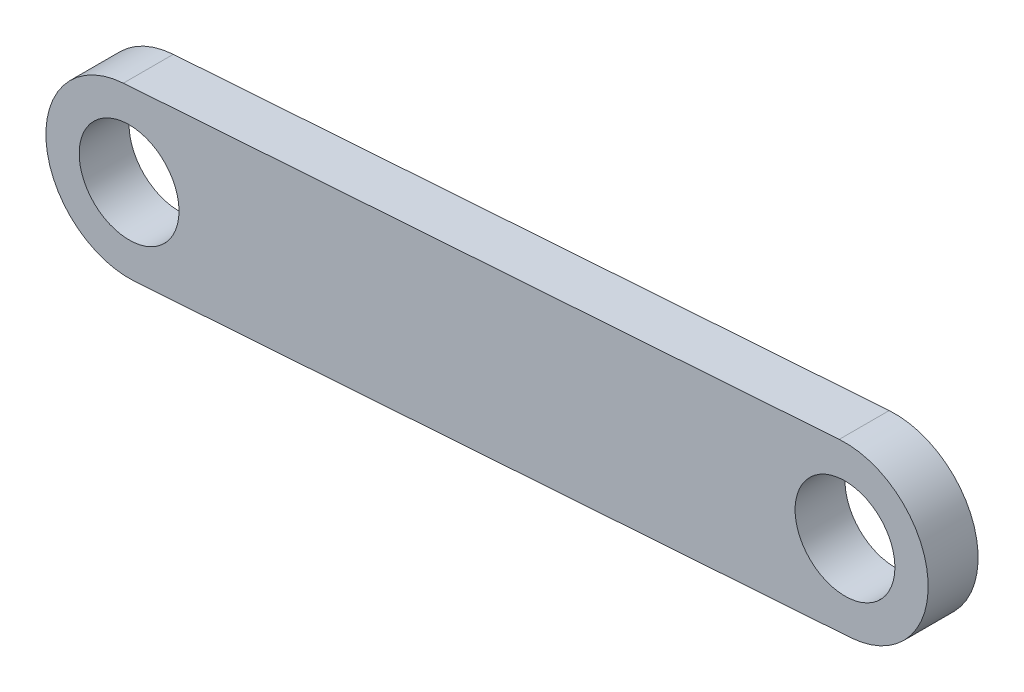
ISO-10303-21;
HEADER;
FILE_DESCRIPTION(('STEP AP214'),'2;1');
FILE_NAME('part.step','',(''),(''),'','','');
FILE_SCHEMA(('AUTOMOTIVE_DESIGN { 1 0 10303 214 1 1 1 1 }'));
ENDSEC;
DATA;
#1=APPLICATION_CONTEXT('core data for automotive mechanical design processes');
#2=APPLICATION_PROTOCOL_DEFINITION('international standard','automotive_design',2000,#1);
#3=PRODUCT_CONTEXT('',#1,'mechanical');
#4=PRODUCT('Part','Part','',(#3));
#5=PRODUCT_RELATED_PRODUCT_CATEGORY('part','',(#4));
#6=PRODUCT_DEFINITION_FORMATION('','',#4);
#7=PRODUCT_DEFINITION_CONTEXT('part definition',#1,'design');
#8=PRODUCT_DEFINITION('design','',#6,#7);
#9=PRODUCT_DEFINITION_SHAPE('','',#8);
#10=(LENGTH_UNIT() NAMED_UNIT(*) SI_UNIT(.MILLI.,.METRE.));
#11=(NAMED_UNIT(*) PLANE_ANGLE_UNIT() SI_UNIT($,.RADIAN.));
#12=(NAMED_UNIT(*) SI_UNIT($,.STERADIAN.) SOLID_ANGLE_UNIT());
#13=UNCERTAINTY_MEASURE_WITH_UNIT(LENGTH_MEASURE(1.E-05),#10,'distance_accuracy_value','');
#14=(GEOMETRIC_REPRESENTATION_CONTEXT(3) GLOBAL_UNCERTAINTY_ASSIGNED_CONTEXT((#13)) GLOBAL_UNIT_ASSIGNED_CONTEXT((#10,
#11,#12)) REPRESENTATION_CONTEXT('',''));
#15=CARTESIAN_POINT('',(0.,0.,0.));
#16=DIRECTION('',(0.,0.,1.));
#17=DIRECTION('',(1.,0.,0.));
#18=AXIS2_PLACEMENT_3D('',#15,#16,#17);
#19=CARTESIAN_POINT('',(0.,0.,7.62));
#20=DIRECTION('',(0.,0.,1.));
#21=DIRECTION('',(1.,0.,0.));
#22=AXIS2_PLACEMENT_3D('',#19,#20,#21);
#23=PLANE('',#22);
#24=CARTESIAN_POINT('',(0.,0.,7.62));
#25=DIRECTION('',(0.,0.,1.));
#26=DIRECTION('',(1.,0.,0.));
#27=AXIS2_PLACEMENT_3D('',#24,#25,#26);
#28=CIRCLE('',#27,7.62);
#29=CARTESIAN_POINT('',(7.62,0.,7.62));
#30=VERTEX_POINT('',#29);
#31=EDGE_CURVE('E102',#30,#30,#28,.T.);
#32=ORIENTED_EDGE('',*,*,#31,.F.);
#33=EDGE_LOOP('',(#32));
#34=FACE_BOUND('',#33,.T.);
#35=CARTESIAN_POINT('',(0.,0.,7.62));
#36=DIRECTION('',(0.,0.,1.));
#37=DIRECTION('',(1.,0.,0.));
#38=AXIS2_PLACEMENT_3D('',#35,#36,#37);
#39=CIRCLE('',#38,12.7);
#40=CARTESIAN_POINT('',(-0.875326503983376,12.6697988741505,7.62));
#41=VERTEX_POINT('',#40);
#42=CARTESIAN_POINT('',(0.875326503983377,-12.6697988741505,7.62));
#43=VERTEX_POINT('',#42);
#44=EDGE_CURVE('E87',#41,#43,#39,.T.);
#45=ORIENTED_EDGE('',*,*,#44,.T.);
#46=DIRECTION('',(0.997621958594524,0.0689233467703446,0.));
#47=VECTOR('',#46,1.);
#48=CARTESIAN_POINT('',(0.875326503983377,-12.6697988741505,7.62));
#49=LINE('',#48,#47);
#50=CARTESIAN_POINT('',(110.152341793531,-5.12010777729385,7.62));
#51=VERTEX_POINT('',#50);
#52=EDGE_CURVE('E82',#43,#51,#49,.T.);
#53=ORIENTED_EDGE('',*,*,#52,.T.);
#54=CARTESIAN_POINT('',(109.277015289548,7.54969109685662,7.62));
#55=DIRECTION('',(0.,0.,1.));
#56=DIRECTION('',(1.,0.,0.));
#57=AXIS2_PLACEMENT_3D('',#54,#55,#56);
#58=CIRCLE('',#57,12.7);
#59=CARTESIAN_POINT('',(108.401688785564,20.2194899710071,7.62));
#60=VERTEX_POINT('',#59);
#61=EDGE_CURVE('E85',#51,#60,#58,.T.);
#62=ORIENTED_EDGE('',*,*,#61,.T.);
#63=DIRECTION('',(-0.997621958594524,-0.0689233467703447,0.));
#64=VECTOR('',#63,1.);
#65=CARTESIAN_POINT('',(-0.875326503983376,12.6697988741505,7.62));
#66=LINE('',#65,#64);
#67=EDGE_CURVE('E52',#60,#41,#66,.T.);
#68=ORIENTED_EDGE('',*,*,#67,.T.);
#69=EDGE_LOOP('',(#45,#53,#62,#68));
#70=FACE_BOUND('',#69,.T.);
#71=CARTESIAN_POINT('',(109.277015289548,7.54969109685662,7.62));
#72=DIRECTION('',(0.,0.,1.));
#73=DIRECTION('',(1.,0.,0.));
#74=AXIS2_PLACEMENT_3D('',#71,#72,#73);
#75=CIRCLE('',#74,7.62000000000003);
#76=CARTESIAN_POINT('',(116.897015289548,7.54969109685662,7.62));
#77=VERTEX_POINT('',#76);
#78=EDGE_CURVE('E117',#77,#77,#75,.T.);
#79=ORIENTED_EDGE('',*,*,#78,.F.);
#80=EDGE_LOOP('',(#79));
#81=FACE_BOUND('',#80,.T.);
#82=ADVANCED_FACE('F35',(#34,#70,#81),#23,.T.);
#83=CARTESIAN_POINT('',(0.,0.,0.));
#84=DIRECTION('',(0.,0.,1.));
#85=DIRECTION('',(1.,0.,0.));
#86=AXIS2_PLACEMENT_3D('',#83,#84,#85);
#87=PLANE('',#86);
#88=CARTESIAN_POINT('',(0.,0.,0.));
#89=DIRECTION('',(0.,0.,1.));
#90=DIRECTION('',(1.,0.,0.));
#91=AXIS2_PLACEMENT_3D('',#88,#89,#90);
#92=CIRCLE('',#91,12.7);
#93=CARTESIAN_POINT('',(-0.875326503983376,12.6697988741505,0.));
#94=VERTEX_POINT('',#93);
#95=CARTESIAN_POINT('',(0.875326503983377,-12.6697988741505,0.));
#96=VERTEX_POINT('',#95);
#97=EDGE_CURVE('E99',#94,#96,#92,.T.);
#98=ORIENTED_EDGE('',*,*,#97,.F.);
#99=DIRECTION('',(-0.997621958594524,-0.0689233467703447,0.));
#100=VECTOR('',#99,1.);
#101=CARTESIAN_POINT('',(-0.875326503983376,12.6697988741505,0.));
#102=LINE('',#101,#100);
#103=CARTESIAN_POINT('',(108.401688785564,20.2194899710071,0.));
#104=VERTEX_POINT('',#103);
#105=EDGE_CURVE('E75',#104,#94,#102,.T.);
#106=ORIENTED_EDGE('',*,*,#105,.F.);
#107=CARTESIAN_POINT('',(109.277015289548,7.54969109685662,0.));
#108=DIRECTION('',(0.,0.,1.));
#109=DIRECTION('',(1.,0.,0.));
#110=AXIS2_PLACEMENT_3D('',#107,#108,#109);
#111=CIRCLE('',#110,12.7);
#112=CARTESIAN_POINT('',(110.152341793531,-5.12010777729385,0.));
#113=VERTEX_POINT('',#112);
#114=EDGE_CURVE('E69',#113,#104,#111,.T.);
#115=ORIENTED_EDGE('',*,*,#114,.F.);
#116=DIRECTION('',(0.997621958594524,0.0689233467703446,0.));
#117=VECTOR('',#116,1.);
#118=CARTESIAN_POINT('',(0.875326503983377,-12.6697988741505,0.));
#119=LINE('',#118,#117);
#120=EDGE_CURVE('E91',#96,#113,#119,.T.);
#121=ORIENTED_EDGE('',*,*,#120,.F.);
#122=EDGE_LOOP('',(#98,#106,#115,#121));
#123=FACE_BOUND('',#122,.T.);
#124=CARTESIAN_POINT('',(0.,0.,0.));
#125=DIRECTION('',(0.,0.,1.));
#126=DIRECTION('',(1.,0.,0.));
#127=AXIS2_PLACEMENT_3D('',#124,#125,#126);
#128=CIRCLE('',#127,7.62);
#129=CARTESIAN_POINT('',(7.62,0.,0.));
#130=VERTEX_POINT('',#129);
#131=EDGE_CURVE('E114',#130,#130,#128,.T.);
#132=ORIENTED_EDGE('',*,*,#131,.T.);
#133=EDGE_LOOP('',(#132));
#134=FACE_BOUND('',#133,.T.);
#135=CARTESIAN_POINT('',(109.277015289548,7.54969109685662,0.));
#136=DIRECTION('',(0.,0.,1.));
#137=DIRECTION('',(1.,0.,0.));
#138=AXIS2_PLACEMENT_3D('',#135,#136,#137);
#139=CIRCLE('',#138,7.62000000000003);
#140=CARTESIAN_POINT('',(116.897015289548,7.54969109685662,0.));
#141=VERTEX_POINT('',#140);
#142=EDGE_CURVE('E120',#141,#141,#139,.T.);
#143=ORIENTED_EDGE('',*,*,#142,.T.);
#144=EDGE_LOOP('',(#143));
#145=FACE_BOUND('',#144,.T.);
#146=ADVANCED_FACE('F110',(#123,#134,#145),#87,.F.);
#147=CARTESIAN_POINT('',(0.,0.,7.62));
#148=DIRECTION('',(0.,0.,-1.));
#149=DIRECTION('',(-1.,0.,0.));
#150=AXIS2_PLACEMENT_3D('',#147,#148,#149);
#151=CYLINDRICAL_SURFACE('',#150,12.7);
#152=ORIENTED_EDGE('',*,*,#97,.T.);
#153=DIRECTION('',(0.,0.,-1.));
#154=VECTOR('',#153,1.);
#155=CARTESIAN_POINT('',(0.875326503983377,-12.6697988741505,7.62));
#156=LINE('',#155,#154);
#157=EDGE_CURVE('E11',#43,#96,#156,.T.);
#158=ORIENTED_EDGE('',*,*,#157,.F.);
#159=ORIENTED_EDGE('',*,*,#44,.F.);
#160=DIRECTION('',(0.,0.,-1.));
#161=VECTOR('',#160,1.);
#162=CARTESIAN_POINT('',(-0.875326503983376,12.6697988741505,7.62));
#163=LINE('',#162,#161);
#164=EDGE_CURVE('E95',#41,#94,#163,.T.);
#165=ORIENTED_EDGE('',*,*,#164,.T.);
#166=EDGE_LOOP('',(#152,#158,#159,#165));
#167=FACE_BOUND('',#166,.T.);
#168=ADVANCED_FACE('F37',(#167),#151,.T.);
#169=CARTESIAN_POINT('',(0.875326503983377,-12.6697988741505,7.62));
#170=DIRECTION('',(-0.0689233467703446,0.997621958594524,0.));
#171=DIRECTION('',(-0.997621958594524,-0.0689233467703446,0.));
#172=AXIS2_PLACEMENT_3D('',#169,#170,#171);
#173=PLANE('',#172);
#174=ORIENTED_EDGE('',*,*,#120,.T.);
#175=DIRECTION('',(0.,0.,-1.));
#176=VECTOR('',#175,1.);
#177=CARTESIAN_POINT('',(110.152341793531,-5.12010777729385,7.62));
#178=LINE('',#177,#176);
#179=EDGE_CURVE('E44',#51,#113,#178,.T.);
#180=ORIENTED_EDGE('',*,*,#179,.F.);
#181=ORIENTED_EDGE('',*,*,#52,.F.);
#182=ORIENTED_EDGE('',*,*,#157,.T.);
#183=EDGE_LOOP('',(#174,#180,#181,#182));
#184=FACE_BOUND('',#183,.T.);
#185=ADVANCED_FACE('F90',(#184),#173,.F.);
#186=CARTESIAN_POINT('',(109.277015289548,7.54969109685662,7.62));
#187=DIRECTION('',(0.,0.,-1.));
#188=DIRECTION('',(-1.,0.,0.));
#189=AXIS2_PLACEMENT_3D('',#186,#187,#188);
#190=CYLINDRICAL_SURFACE('',#189,12.7);
#191=ORIENTED_EDGE('',*,*,#114,.T.);
#192=DIRECTION('',(0.,0.,-1.));
#193=VECTOR('',#192,1.);
#194=CARTESIAN_POINT('',(108.401688785564,20.2194899710071,7.62));
#195=LINE('',#194,#193);
#196=EDGE_CURVE('E92',#60,#104,#195,.T.);
#197=ORIENTED_EDGE('',*,*,#196,.F.);
#198=ORIENTED_EDGE('',*,*,#61,.F.);
#199=ORIENTED_EDGE('',*,*,#179,.T.);
#200=EDGE_LOOP('',(#191,#197,#198,#199));
#201=FACE_BOUND('',#200,.T.);
#202=ADVANCED_FACE('F93',(#201),#190,.T.);
#203=CARTESIAN_POINT('',(-0.875326503983376,12.6697988741505,7.62));
#204=DIRECTION('',(0.0689233467703446,-0.997621958594524,0.));
#205=DIRECTION('',(0.997621958594524,0.0689233467703446,0.));
#206=AXIS2_PLACEMENT_3D('',#203,#204,#205);
#207=PLANE('',#206);
#208=ORIENTED_EDGE('',*,*,#105,.T.);
#209=ORIENTED_EDGE('',*,*,#164,.F.);
#210=ORIENTED_EDGE('',*,*,#67,.F.);
#211=ORIENTED_EDGE('',*,*,#196,.T.);
#212=EDGE_LOOP('',(#208,#209,#210,#211));
#213=FACE_BOUND('',#212,.T.);
#214=ADVANCED_FACE('F107',(#213),#207,.F.);
#215=CARTESIAN_POINT('',(0.,0.,7.62));
#216=DIRECTION('',(0.,0.,-1.));
#217=DIRECTION('',(-1.,0.,0.));
#218=AXIS2_PLACEMENT_3D('',#215,#216,#217);
#219=CYLINDRICAL_SURFACE('',#218,7.62);
#220=ORIENTED_EDGE('',*,*,#31,.T.);
#221=EDGE_LOOP('',(#220));
#222=FACE_BOUND('',#221,.T.);
#223=ORIENTED_EDGE('',*,*,#131,.F.);
#224=EDGE_LOOP('',(#223));
#225=FACE_BOUND('',#224,.T.);
#226=ADVANCED_FACE('F137',(#222,#225),#219,.F.);
#227=CARTESIAN_POINT('',(109.277015289548,7.54969109685662,7.62));
#228=DIRECTION('',(0.,0.,-1.));
#229=DIRECTION('',(-1.,0.,0.));
#230=AXIS2_PLACEMENT_3D('',#227,#228,#229);
#231=CYLINDRICAL_SURFACE('',#230,7.62000000000003);
#232=ORIENTED_EDGE('',*,*,#78,.T.);
#233=EDGE_LOOP('',(#232));
#234=FACE_BOUND('',#233,.T.);
#235=ORIENTED_EDGE('',*,*,#142,.F.);
#236=EDGE_LOOP('',(#235));
#237=FACE_BOUND('',#236,.T.);
#238=ADVANCED_FACE('F126',(#234,#237),#231,.F.);
#239=CLOSED_SHELL('',(#82,#146,#168,#185,#202,#214,#226,#238));
#240=MANIFOLD_SOLID_BREP('B2',#239);
#241=ADVANCED_BREP_SHAPE_REPRESENTATION('',(#18,#240),#14);
#242=SHAPE_DEFINITION_REPRESENTATION(#9,#241);
ENDSEC;
END-ISO-10303-21;
